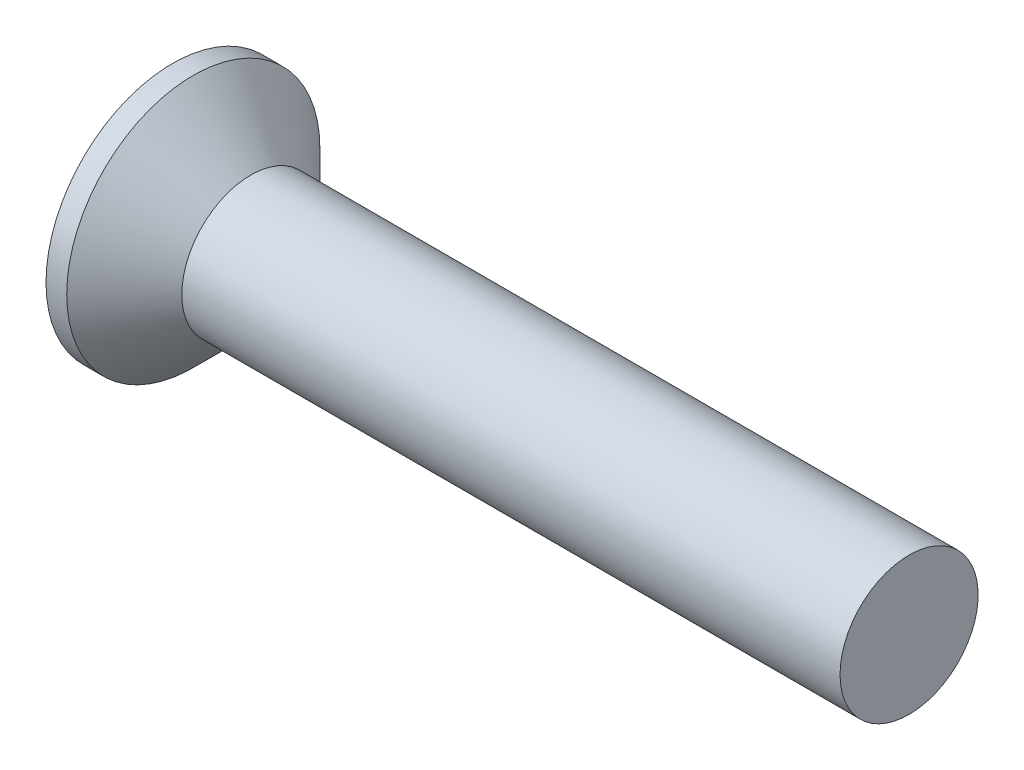
ISO-10303-21;
HEADER;
FILE_DESCRIPTION(('STEP AP214'),'2;1');
FILE_NAME('part.step','',(''),(''),'','','');
FILE_SCHEMA(('AUTOMOTIVE_DESIGN { 1 0 10303 214 1 1 1 1 }'));
ENDSEC;
DATA;
#1=APPLICATION_CONTEXT('core data for automotive mechanical design processes');
#2=APPLICATION_PROTOCOL_DEFINITION('international standard','automotive_design',2000,#1);
#3=PRODUCT_CONTEXT('',#1,'mechanical');
#4=PRODUCT('Part','Part','',(#3));
#5=PRODUCT_RELATED_PRODUCT_CATEGORY('part','',(#4));
#6=PRODUCT_DEFINITION_FORMATION('','',#4);
#7=PRODUCT_DEFINITION_CONTEXT('part definition',#1,'design');
#8=PRODUCT_DEFINITION('design','',#6,#7);
#9=PRODUCT_DEFINITION_SHAPE('','',#8);
#10=(LENGTH_UNIT() NAMED_UNIT(*) SI_UNIT(.MILLI.,.METRE.));
#11=(NAMED_UNIT(*) PLANE_ANGLE_UNIT() SI_UNIT($,.RADIAN.));
#12=(NAMED_UNIT(*) SI_UNIT($,.STERADIAN.) SOLID_ANGLE_UNIT());
#13=UNCERTAINTY_MEASURE_WITH_UNIT(LENGTH_MEASURE(1.E-05),#10,'distance_accuracy_value','');
#14=(GEOMETRIC_REPRESENTATION_CONTEXT(3) GLOBAL_UNCERTAINTY_ASSIGNED_CONTEXT((#13)) GLOBAL_UNIT_ASSIGNED_CONTEXT((#10,
#11,#12)) REPRESENTATION_CONTEXT('',''));
#15=CARTESIAN_POINT('',(0.,0.,0.));
#16=DIRECTION('',(0.,0.,1.));
#17=DIRECTION('',(1.,0.,0.));
#18=AXIS2_PLACEMENT_3D('',#15,#16,#17);
#19=CARTESIAN_POINT('',(0.,0.,0.));
#20=DIRECTION('',(-1.,0.,0.));
#21=DIRECTION('',(0.,0.,1.));
#22=AXIS2_PLACEMENT_3D('',#19,#20,#21);
#23=PLANE('',#22);
#24=CARTESIAN_POINT('',(0.,0.,0.));
#25=DIRECTION('',(-1.,0.,0.));
#26=DIRECTION('',(0.,0.,1.));
#27=AXIS2_PLACEMENT_3D('',#24,#25,#26);
#28=CIRCLE('',#27,2.75);
#29=CARTESIAN_POINT('',(0.,0.,2.75));
#30=VERTEX_POINT('',#29);
#31=EDGE_CURVE('E44',#30,#30,#28,.T.);
#32=ORIENTED_EDGE('',*,*,#31,.T.);
#33=EDGE_LOOP('',(#32));
#34=FACE_BOUND('',#33,.T.);
#35=DIRECTION('',(0.,1.,0.));
#36=VECTOR('',#35,1.);
#37=CARTESIAN_POINT('',(0.,-1.55,-0.395));
#38=LINE('',#37,#36);
#39=CARTESIAN_POINT('',(0.,-1.55,-0.395));
#40=VERTEX_POINT('',#39);
#41=CARTESIAN_POINT('',(0.,-0.394999999999999,-0.395));
#42=VERTEX_POINT('',#41);
#43=EDGE_CURVE('E105',#40,#42,#38,.T.);
#44=ORIENTED_EDGE('',*,*,#43,.T.);
#45=DIRECTION('',(0.,0.,-1.));
#46=VECTOR('',#45,1.);
#47=CARTESIAN_POINT('',(0.,-0.395000000000005,1.55));
#48=LINE('',#47,#46);
#49=CARTESIAN_POINT('',(0.,-0.394999999999995,-1.55));
#50=VERTEX_POINT('',#49);
#51=EDGE_CURVE('E85',#42,#50,#48,.T.);
#52=ORIENTED_EDGE('',*,*,#51,.T.);
#53=DIRECTION('',(0.,1.,0.));
#54=VECTOR('',#53,1.);
#55=CARTESIAN_POINT('',(0.,-0.394999999999995,-1.55));
#56=LINE('',#55,#54);
#57=CARTESIAN_POINT('',(0.,0.395000000000005,-1.55));
#58=VERTEX_POINT('',#57);
#59=EDGE_CURVE('E344',#50,#58,#56,.T.);
#60=ORIENTED_EDGE('',*,*,#59,.T.);
#61=DIRECTION('',(0.,0.,1.));
#62=VECTOR('',#61,1.);
#63=CARTESIAN_POINT('',(0.,0.395000000000005,-1.55));
#64=LINE('',#63,#62);
#65=CARTESIAN_POINT('',(0.,0.395000000000001,-0.395));
#66=VERTEX_POINT('',#65);
#67=EDGE_CURVE('E101',#58,#66,#64,.T.);
#68=ORIENTED_EDGE('',*,*,#67,.T.);
#69=CARTESIAN_POINT('',(0.,1.55,-0.395));
#70=VERTEX_POINT('',#69);
#71=EDGE_CURVE('E95',#66,#70,#38,.T.);
#72=ORIENTED_EDGE('',*,*,#71,.T.);
#73=DIRECTION('',(0.,0.,1.));
#74=VECTOR('',#73,1.);
#75=CARTESIAN_POINT('',(0.,1.55,-0.395));
#76=LINE('',#75,#74);
#77=CARTESIAN_POINT('',(0.,1.55,0.395));
#78=VERTEX_POINT('',#77);
#79=EDGE_CURVE('E98',#70,#78,#76,.T.);
#80=ORIENTED_EDGE('',*,*,#79,.T.);
#81=DIRECTION('',(0.,-1.,0.));
#82=VECTOR('',#81,1.);
#83=CARTESIAN_POINT('',(0.,1.55,0.395));
#84=LINE('',#83,#82);
#85=CARTESIAN_POINT('',(0.,0.394999999999998,0.395));
#86=VERTEX_POINT('',#85);
#87=EDGE_CURVE('E356',#78,#86,#84,.T.);
#88=ORIENTED_EDGE('',*,*,#87,.T.);
#89=CARTESIAN_POINT('',(0.,0.394999999999994,1.55));
#90=VERTEX_POINT('',#89);
#91=EDGE_CURVE('E339',#86,#90,#64,.T.);
#92=ORIENTED_EDGE('',*,*,#91,.T.);
#93=DIRECTION('',(0.,-1.,0.));
#94=VECTOR('',#93,1.);
#95=CARTESIAN_POINT('',(0.,0.394999999999994,1.55));
#96=LINE('',#95,#94);
#97=CARTESIAN_POINT('',(0.,-0.395000000000005,1.55));
#98=VERTEX_POINT('',#97);
#99=EDGE_CURVE('E325',#90,#98,#96,.T.);
#100=ORIENTED_EDGE('',*,*,#99,.T.);
#101=CARTESIAN_POINT('',(0.,-0.395000000000001,0.395));
#102=VERTEX_POINT('',#101);
#103=EDGE_CURVE('E337',#98,#102,#48,.T.);
#104=ORIENTED_EDGE('',*,*,#103,.T.);
#105=CARTESIAN_POINT('',(0.,-1.55,0.395));
#106=VERTEX_POINT('',#105);
#107=EDGE_CURVE('E111',#102,#106,#84,.T.);
#108=ORIENTED_EDGE('',*,*,#107,.T.);
#109=DIRECTION('',(0.,0.,-1.));
#110=VECTOR('',#109,1.);
#111=CARTESIAN_POINT('',(0.,-1.55,0.395));
#112=LINE('',#111,#110);
#113=EDGE_CURVE('E134',#106,#40,#112,.T.);
#114=ORIENTED_EDGE('',*,*,#113,.T.);
#115=EDGE_LOOP('',(#44,#52,#60,#68,#72,#80,#88,#92,#100,#104,#108,#114));
#116=FACE_BOUND('',#115,.T.);
#117=ADVANCED_FACE('F37',(#34,#116),#23,.T.);
#118=CARTESIAN_POINT('',(2.38373382624769,0.,0.16865988909427));
#119=DIRECTION('',(-0.0945267588569115,0.,-0.995522321125954));
#120=DIRECTION('',(-0.995522321125954,0.,0.0945267588569115));
#121=AXIS2_PLACEMENT_3D('',#118,#119,#120);
#122=PLANE('',#121);
#123=ORIENTED_EDGE('',*,*,#107,.F.);
#124=DIRECTION('',(0.991104257398676,0.0941072552097304,-0.0941072552097301));
#125=VECTOR('',#124,1.);
#126=CARTESIAN_POINT('',(2.39946475118715,-0.16716620751949,0.167166207519489));
#127=LINE('',#126,#125);
#128=CARTESIAN_POINT('',(2.08,-0.197500000000001,0.197499999999999));
#129=VERTEX_POINT('',#128);
#130=EDGE_CURVE('E129',#102,#129,#127,.T.);
#131=ORIENTED_EDGE('',*,*,#130,.T.);
#132=DIRECTION('',(0.835707904588477,0.543411029305728,-0.0793520726712617));
#133=VECTOR('',#132,1.);
#134=CARTESIAN_POINT('',(0.,-1.55,0.395));
#135=LINE('',#134,#133);
#136=EDGE_CURVE('E106',#106,#129,#135,.T.);
#137=ORIENTED_EDGE('',*,*,#136,.F.);
#138=EDGE_LOOP('',(#123,#131,#137));
#139=FACE_BOUND('',#138,.T.);
#140=ADVANCED_FACE('F157',(#139),#122,.T.);
#141=DIRECTION('',(0.835707904588477,-0.543411029305729,-0.0793520726712616));
#142=VECTOR('',#141,1.);
#143=CARTESIAN_POINT('',(0.,1.55,0.395));
#144=LINE('',#143,#142);
#145=CARTESIAN_POINT('',(2.08,0.1975,0.1975));
#146=VERTEX_POINT('',#145);
#147=EDGE_CURVE('E51',#78,#146,#144,.T.);
#148=ORIENTED_EDGE('',*,*,#147,.T.);
#149=DIRECTION('',(-0.991104257398676,0.0941072552097297,0.09410725520973));
#150=VECTOR('',#149,1.);
#151=CARTESIAN_POINT('',(2.39946475118715,0.167166207519489,0.167166207519489));
#152=LINE('',#151,#150);
#153=EDGE_CURVE('E352',#146,#86,#152,.T.);
#154=ORIENTED_EDGE('',*,*,#153,.T.);
#155=ORIENTED_EDGE('',*,*,#87,.F.);
#156=EDGE_LOOP('',(#148,#154,#155));
#157=FACE_BOUND('',#156,.T.);
#158=ADVANCED_FACE('F161',(#157),#122,.T.);
#159=CARTESIAN_POINT('',(2.38373382624769,0.,-0.16865988909427));
#160=DIRECTION('',(-0.0945267588569114,0.,0.995522321125954));
#161=DIRECTION('',(0.995522321125954,0.,0.0945267588569114));
#162=AXIS2_PLACEMENT_3D('',#159,#160,#161);
#163=PLANE('',#162);
#164=DIRECTION('',(0.835707904588477,0.543411029305729,0.0793520726712616));
#165=VECTOR('',#164,1.);
#166=CARTESIAN_POINT('',(0.,-1.55,-0.395));
#167=LINE('',#166,#165);
#168=CARTESIAN_POINT('',(2.08,-0.197499999999999,-0.197500000000001));
#169=VERTEX_POINT('',#168);
#170=EDGE_CURVE('E60',#40,#169,#167,.T.);
#171=ORIENTED_EDGE('',*,*,#170,.T.);
#172=DIRECTION('',(-0.991104257398676,-0.0941072552097297,-0.09410725520973));
#173=VECTOR('',#172,1.);
#174=CARTESIAN_POINT('',(2.39946475118715,-0.167166207519489,-0.167166207519489));
#175=LINE('',#174,#173);
#176=EDGE_CURVE('E11',#169,#42,#175,.T.);
#177=ORIENTED_EDGE('',*,*,#176,.T.);
#178=ORIENTED_EDGE('',*,*,#43,.F.);
#179=EDGE_LOOP('',(#171,#177,#178));
#180=FACE_BOUND('',#179,.T.);
#181=ADVANCED_FACE('F154',(#180),#163,.T.);
#182=ORIENTED_EDGE('',*,*,#71,.F.);
#183=DIRECTION('',(0.991104257398676,-0.0941072552097303,0.09410725520973));
#184=VECTOR('',#183,1.);
#185=CARTESIAN_POINT('',(2.39946475118715,0.16716620751949,-0.167166207519489));
#186=LINE('',#185,#184);
#187=CARTESIAN_POINT('',(2.08,0.1975,-0.1975));
#188=VERTEX_POINT('',#187);
#189=EDGE_CURVE('E114',#66,#188,#186,.T.);
#190=ORIENTED_EDGE('',*,*,#189,.T.);
#191=DIRECTION('',(0.835707904588477,-0.543411029305729,0.0793520726712616));
#192=VECTOR('',#191,1.);
#193=CARTESIAN_POINT('',(0.,1.55,-0.395));
#194=LINE('',#193,#192);
#195=EDGE_CURVE('E110',#70,#188,#194,.T.);
#196=ORIENTED_EDGE('',*,*,#195,.F.);
#197=EDGE_LOOP('',(#182,#190,#196));
#198=FACE_BOUND('',#197,.T.);
#199=ADVANCED_FACE('F113',(#198),#163,.T.);
#200=CARTESIAN_POINT('',(-6.34999999999999,0.,0.));
#201=DIRECTION('',(-1.,0.,0.));
#202=DIRECTION('',(0.,0.,1.));
#203=AXIS2_PLACEMENT_3D('',#200,#201,#202);
#204=CYLINDRICAL_SURFACE('',#203,2.75);
#205=CARTESIAN_POINT('',(0.450000000000004,0.,0.));
#206=DIRECTION('',(-1.,0.,0.));
#207=DIRECTION('',(0.,0.,1.));
#208=AXIS2_PLACEMENT_3D('',#205,#206,#207);
#209=CIRCLE('',#208,2.75);
#210=CARTESIAN_POINT('',(0.450000000000004,0.,2.75));
#211=VERTEX_POINT('',#210);
#212=EDGE_CURVE('E137',#211,#211,#209,.T.);
#213=ORIENTED_EDGE('',*,*,#212,.T.);
#214=EDGE_LOOP('',(#213));
#215=FACE_BOUND('',#214,.T.);
#216=ORIENTED_EDGE('',*,*,#31,.F.);
#217=EDGE_LOOP('',(#216));
#218=FACE_BOUND('',#217,.T.);
#219=ADVANCED_FACE('F143',(#215,#218),#204,.T.);
#220=CARTESIAN_POINT('',(0.450000000000004,0.,0.));
#221=DIRECTION('',(-1.,0.,0.));
#222=DIRECTION('',(0.,0.,1.));
#223=AXIS2_PLACEMENT_3D('',#220,#221,#222);
#224=CONICAL_SURFACE('',#223,2.75,0.78539816339745);
#225=CARTESIAN_POINT('',(1.7,0.,0.));
#226=DIRECTION('',(-1.,0.,0.));
#227=DIRECTION('',(0.,0.,1.));
#228=AXIS2_PLACEMENT_3D('',#225,#226,#227);
#229=CIRCLE('',#228,1.5);
#230=CARTESIAN_POINT('',(1.7,0.,1.5));
#231=VERTEX_POINT('',#230);
#232=EDGE_CURVE('E133',#231,#231,#229,.T.);
#233=ORIENTED_EDGE('',*,*,#232,.T.);
#234=EDGE_LOOP('',(#233));
#235=FACE_BOUND('',#234,.T.);
#236=ORIENTED_EDGE('',*,*,#212,.F.);
#237=EDGE_LOOP('',(#236));
#238=FACE_BOUND('',#237,.T.);
#239=ADVANCED_FACE('F145',(#235,#238),#224,.T.);
#240=CARTESIAN_POINT('',(-6.34999999999999,0.,0.));
#241=DIRECTION('',(-1.,0.,0.));
#242=DIRECTION('',(0.,0.,1.));
#243=AXIS2_PLACEMENT_3D('',#240,#241,#242);
#244=CYLINDRICAL_SURFACE('',#243,1.5);
#245=CARTESIAN_POINT('',(16.,0.,0.));
#246=DIRECTION('',(-1.,0.,0.));
#247=DIRECTION('',(0.,0.,1.));
#248=AXIS2_PLACEMENT_3D('',#245,#246,#247);
#249=CIRCLE('',#248,1.5);
#250=CARTESIAN_POINT('',(16.,0.,1.5));
#251=VERTEX_POINT('',#250);
#252=EDGE_CURVE('E130',#251,#251,#249,.T.);
#253=ORIENTED_EDGE('',*,*,#252,.T.);
#254=EDGE_LOOP('',(#253));
#255=FACE_BOUND('',#254,.T.);
#256=ORIENTED_EDGE('',*,*,#232,.F.);
#257=EDGE_LOOP('',(#256));
#258=FACE_BOUND('',#257,.T.);
#259=ADVANCED_FACE('F151',(#255,#258),#244,.T.);
#260=CARTESIAN_POINT('',(16.,1.5,0.));
#261=DIRECTION('',(1.,0.,0.));
#262=DIRECTION('',(0.,0.,-1.));
#263=AXIS2_PLACEMENT_3D('',#260,#261,#262);
#264=PLANE('',#263);
#265=ORIENTED_EDGE('',*,*,#252,.F.);
#266=EDGE_LOOP('',(#265));
#267=FACE_BOUND('',#266,.T.);
#268=ADVANCED_FACE('F181',(#267),#264,.T.);
#269=CARTESIAN_POINT('',(2.08,0.1975,-0.1975));
#270=DIRECTION('',(1.,0.,0.));
#271=DIRECTION('',(0.,0.,-1.));
#272=AXIS2_PLACEMENT_3D('',#269,#270,#271);
#273=PLANE('',#272);
#274=DIRECTION('',(0.,1.,0.));
#275=VECTOR('',#274,1.);
#276=CARTESIAN_POINT('',(2.08,-0.1975,-0.1975));
#277=LINE('',#276,#275);
#278=EDGE_CURVE('E125',#169,#188,#277,.T.);
#279=ORIENTED_EDGE('',*,*,#278,.F.);
#280=DIRECTION('',(0.,0.,-1.));
#281=VECTOR('',#280,1.);
#282=CARTESIAN_POINT('',(2.08,-0.1975,0.1975));
#283=LINE('',#282,#281);
#284=EDGE_CURVE('E116',#129,#169,#283,.T.);
#285=ORIENTED_EDGE('',*,*,#284,.F.);
#286=DIRECTION('',(0.,-1.,0.));
#287=VECTOR('',#286,1.);
#288=CARTESIAN_POINT('',(2.08,0.1975,0.1975));
#289=LINE('',#288,#287);
#290=EDGE_CURVE('E119',#146,#129,#289,.T.);
#291=ORIENTED_EDGE('',*,*,#290,.F.);
#292=DIRECTION('',(0.,0.,1.));
#293=VECTOR('',#292,1.);
#294=CARTESIAN_POINT('',(2.08,0.1975,-0.1975));
#295=LINE('',#294,#293);
#296=EDGE_CURVE('E123',#188,#146,#295,.T.);
#297=ORIENTED_EDGE('',*,*,#296,.F.);
#298=EDGE_LOOP('',(#279,#285,#291,#297));
#299=FACE_BOUND('',#298,.T.);
#300=ADVANCED_FACE('F178',(#299),#273,.F.);
#301=CARTESIAN_POINT('',(0.,-1.55,-0.395));
#302=DIRECTION('',(-0.54513001368185,0.838351518268576,0.));
#303=DIRECTION('',(-0.838351518268576,-0.54513001368185,0.));
#304=AXIS2_PLACEMENT_3D('',#301,#302,#303);
#305=PLANE('',#304);
#306=ORIENTED_EDGE('',*,*,#170,.F.);
#307=ORIENTED_EDGE('',*,*,#113,.F.);
#308=ORIENTED_EDGE('',*,*,#136,.T.);
#309=ORIENTED_EDGE('',*,*,#284,.T.);
#310=EDGE_LOOP('',(#306,#307,#308,#309));
#311=FACE_BOUND('',#310,.T.);
#312=ADVANCED_FACE('F170',(#311),#305,.T.);
#313=CARTESIAN_POINT('',(0.,1.55,0.395));
#314=DIRECTION('',(-0.54513001368185,-0.838351518268576,0.));
#315=DIRECTION('',(0.838351518268576,-0.54513001368185,0.));
#316=AXIS2_PLACEMENT_3D('',#313,#314,#315);
#317=PLANE('',#316);
#318=ORIENTED_EDGE('',*,*,#147,.F.);
#319=ORIENTED_EDGE('',*,*,#79,.F.);
#320=ORIENTED_EDGE('',*,*,#195,.T.);
#321=ORIENTED_EDGE('',*,*,#296,.T.);
#322=EDGE_LOOP('',(#318,#319,#320,#321));
#323=FACE_BOUND('',#322,.T.);
#324=ADVANCED_FACE('F109',(#323),#317,.T.);
#325=CARTESIAN_POINT('',(2.38373382624769,-0.16865988909427,0.));
#326=DIRECTION('',(-0.0945267588569115,0.995522321125954,0.));
#327=DIRECTION('',(-0.995522321125954,-0.0945267588569115,0.));
#328=AXIS2_PLACEMENT_3D('',#325,#326,#327);
#329=PLANE('',#328);
#330=DIRECTION('',(0.835707904588477,0.0793520726712598,0.543411029305729));
#331=VECTOR('',#330,1.);
#332=CARTESIAN_POINT('',(0.,-0.394999999999995,-1.55));
#333=LINE('',#332,#331);
#334=EDGE_CURVE('E346',#50,#169,#333,.T.);
#335=ORIENTED_EDGE('',*,*,#334,.F.);
#336=ORIENTED_EDGE('',*,*,#51,.F.);
#337=ORIENTED_EDGE('',*,*,#176,.F.);
#338=EDGE_LOOP('',(#335,#336,#337));
#339=FACE_BOUND('',#338,.T.);
#340=ADVANCED_FACE('F177',(#339),#329,.T.);
#341=CARTESIAN_POINT('',(2.38373382624769,0.16865988909427,0.));
#342=DIRECTION('',(-0.0945267588569114,-0.995522321125954,0.));
#343=DIRECTION('',(0.995522321125954,-0.0945267588569114,0.));
#344=AXIS2_PLACEMENT_3D('',#341,#342,#343);
#345=PLANE('',#344);
#346=ORIENTED_EDGE('',*,*,#67,.F.);
#347=DIRECTION('',(0.835707904588477,-0.0793520726712635,0.543411029305728));
#348=VECTOR('',#347,1.);
#349=CARTESIAN_POINT('',(0.,0.395000000000005,-1.55));
#350=LINE('',#349,#348);
#351=EDGE_CURVE('E76',#58,#188,#350,.T.);
#352=ORIENTED_EDGE('',*,*,#351,.T.);
#353=ORIENTED_EDGE('',*,*,#189,.F.);
#354=EDGE_LOOP('',(#346,#352,#353));
#355=FACE_BOUND('',#354,.T.);
#356=ADVANCED_FACE('F222',(#355),#345,.T.);
#357=CARTESIAN_POINT('',(0.,0.395000000000005,-1.55));
#358=DIRECTION('',(-0.54513001368185,0.,0.838351518268576));
#359=DIRECTION('',(-0.838351518268576,0.,-0.54513001368185));
#360=AXIS2_PLACEMENT_3D('',#357,#358,#359);
#361=PLANE('',#360);
#362=ORIENTED_EDGE('',*,*,#351,.F.);
#363=ORIENTED_EDGE('',*,*,#59,.F.);
#364=ORIENTED_EDGE('',*,*,#334,.T.);
#365=ORIENTED_EDGE('',*,*,#278,.T.);
#366=EDGE_LOOP('',(#362,#363,#364,#365));
#367=FACE_BOUND('',#366,.T.);
#368=ADVANCED_FACE('F230',(#367),#361,.T.);
#369=ORIENTED_EDGE('',*,*,#103,.F.);
#370=DIRECTION('',(0.835707904588477,0.0793520726712635,-0.543411029305728));
#371=VECTOR('',#370,1.);
#372=CARTESIAN_POINT('',(0.,-0.395000000000005,1.55));
#373=LINE('',#372,#371);
#374=EDGE_CURVE('E322',#98,#129,#373,.T.);
#375=ORIENTED_EDGE('',*,*,#374,.T.);
#376=ORIENTED_EDGE('',*,*,#130,.F.);
#377=EDGE_LOOP('',(#369,#375,#376));
#378=FACE_BOUND('',#377,.T.);
#379=ADVANCED_FACE('F224',(#378),#329,.T.);
#380=DIRECTION('',(0.835707904588477,-0.0793520726712597,-0.543411029305729));
#381=VECTOR('',#380,1.);
#382=CARTESIAN_POINT('',(0.,0.394999999999994,1.55));
#383=LINE('',#382,#381);
#384=EDGE_CURVE('E333',#90,#146,#383,.T.);
#385=ORIENTED_EDGE('',*,*,#384,.F.);
#386=ORIENTED_EDGE('',*,*,#91,.F.);
#387=ORIENTED_EDGE('',*,*,#153,.F.);
#388=EDGE_LOOP('',(#385,#386,#387));
#389=FACE_BOUND('',#388,.T.);
#390=ADVANCED_FACE('F232',(#389),#345,.T.);
#391=CARTESIAN_POINT('',(0.,-0.395000000000005,1.55));
#392=DIRECTION('',(-0.54513001368185,0.,-0.838351518268576));
#393=DIRECTION('',(0.838351518268576,0.,-0.54513001368185));
#394=AXIS2_PLACEMENT_3D('',#391,#392,#393);
#395=PLANE('',#394);
#396=ORIENTED_EDGE('',*,*,#374,.F.);
#397=ORIENTED_EDGE('',*,*,#99,.F.);
#398=ORIENTED_EDGE('',*,*,#384,.T.);
#399=ORIENTED_EDGE('',*,*,#290,.T.);
#400=EDGE_LOOP('',(#396,#397,#398,#399));
#401=FACE_BOUND('',#400,.T.);
#402=ADVANCED_FACE('F251',(#401),#395,.T.);
#403=CLOSED_SHELL('',(#117,#140,#158,#181,#199,#219,#239,#259,#268,#300,#312,#324,#340,#356,
#368,#379,#390,#402));
#404=MANIFOLD_SOLID_BREP('B2',#403);
#405=ADVANCED_BREP_SHAPE_REPRESENTATION('',(#18,#404),#14);
#406=SHAPE_DEFINITION_REPRESENTATION(#9,#405);
ENDSEC;
END-ISO-10303-21;
